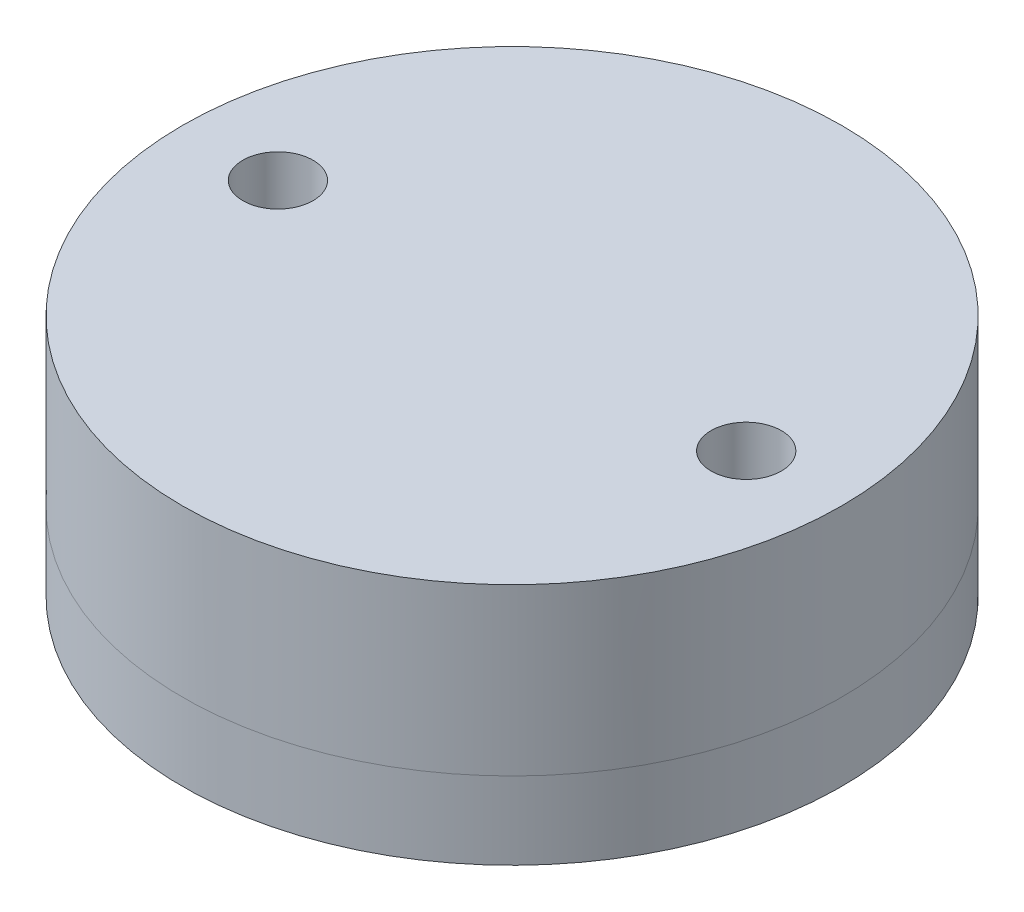
ISO-10303-21;
HEADER;
FILE_DESCRIPTION(('STEP AP214'),'2;1');
FILE_NAME('part.step','',(''),(''),'','','');
FILE_SCHEMA(('AUTOMOTIVE_DESIGN { 1 0 10303 214 1 1 1 1 }'));
ENDSEC;
DATA;
#1=APPLICATION_CONTEXT('core data for automotive mechanical design processes');
#2=APPLICATION_PROTOCOL_DEFINITION('international standard','automotive_design',2000,#1);
#3=PRODUCT_CONTEXT('',#1,'mechanical');
#4=PRODUCT('Part','Part','',(#3));
#5=PRODUCT_RELATED_PRODUCT_CATEGORY('part','',(#4));
#6=PRODUCT_DEFINITION_FORMATION('','',#4);
#7=PRODUCT_DEFINITION_CONTEXT('part definition',#1,'design');
#8=PRODUCT_DEFINITION('design','',#6,#7);
#9=PRODUCT_DEFINITION_SHAPE('','',#8);
#10=(LENGTH_UNIT() NAMED_UNIT(*) SI_UNIT(.MILLI.,.METRE.));
#11=(NAMED_UNIT(*) PLANE_ANGLE_UNIT() SI_UNIT($,.RADIAN.));
#12=(NAMED_UNIT(*) SI_UNIT($,.STERADIAN.) SOLID_ANGLE_UNIT());
#13=UNCERTAINTY_MEASURE_WITH_UNIT(LENGTH_MEASURE(1.E-05),#10,'distance_accuracy_value','');
#14=(GEOMETRIC_REPRESENTATION_CONTEXT(3) GLOBAL_UNCERTAINTY_ASSIGNED_CONTEXT((#13)) GLOBAL_UNIT_ASSIGNED_CONTEXT((#10,
#11,#12)) REPRESENTATION_CONTEXT('',''));
#15=CARTESIAN_POINT('',(0.,0.,0.));
#16=DIRECTION('',(0.,0.,1.));
#17=DIRECTION('',(1.,0.,0.));
#18=AXIS2_PLACEMENT_3D('',#15,#16,#17);
#19=CARTESIAN_POINT('',(0.,3.12256184688707,0.));
#20=DIRECTION('',(0.,1.,0.));
#21=DIRECTION('',(0.,0.,1.));
#22=AXIS2_PLACEMENT_3D('',#19,#20,#21);
#23=PLANE('',#22);
#24=CARTESIAN_POINT('',(-10.,3.12256184688707,0.));
#25=DIRECTION('',(0.,1.,0.));
#26=DIRECTION('',(0.,0.,1.));
#27=AXIS2_PLACEMENT_3D('',#24,#25,#26);
#28=CIRCLE('',#27,1.5);
#29=CARTESIAN_POINT('',(-10.,3.12256184688707,1.5));
#30=VERTEX_POINT('',#29);
#31=EDGE_CURVE('E79',#30,#30,#28,.T.);
#32=ORIENTED_EDGE('',*,*,#31,.T.);
#33=EDGE_LOOP('',(#32));
#34=FACE_BOUND('',#33,.T.);
#35=CARTESIAN_POINT('',(10.,3.12256184688707,0.));
#36=DIRECTION('',(0.,1.,0.));
#37=DIRECTION('',(0.,0.,1.));
#38=AXIS2_PLACEMENT_3D('',#35,#36,#37);
#39=CIRCLE('',#38,1.5);
#40=CARTESIAN_POINT('',(10.,3.12256184688707,1.5));
#41=VERTEX_POINT('',#40);
#42=EDGE_CURVE('E71',#41,#41,#39,.T.);
#43=ORIENTED_EDGE('',*,*,#42,.T.);
#44=EDGE_LOOP('',(#43));
#45=FACE_BOUND('',#44,.T.);
#46=CARTESIAN_POINT('',(0.,3.12256184688707,0.));
#47=DIRECTION('',(0.,-1.,0.));
#48=DIRECTION('',(0.,0.,-1.));
#49=AXIS2_PLACEMENT_3D('',#46,#47,#48);
#50=CIRCLE('',#49,7.36882129277567);
#51=CARTESIAN_POINT('',(0.,3.12256184688707,-7.36882129277567));
#52=VERTEX_POINT('',#51);
#53=EDGE_CURVE('E11',#52,#52,#50,.T.);
#54=ORIENTED_EDGE('',*,*,#53,.F.);
#55=EDGE_LOOP('',(#54));
#56=FACE_BOUND('',#55,.T.);
#57=CARTESIAN_POINT('',(0.,3.12256184688707,0.));
#58=DIRECTION('',(0.,-1.,0.));
#59=DIRECTION('',(0.,0.,-1.));
#60=AXIS2_PLACEMENT_3D('',#57,#58,#59);
#61=CIRCLE('',#60,14.075);
#62=CARTESIAN_POINT('',(0.,3.12256184688707,-14.075));
#63=VERTEX_POINT('',#62);
#64=EDGE_CURVE('E83',#63,#63,#61,.T.);
#65=ORIENTED_EDGE('',*,*,#64,.T.);
#66=EDGE_LOOP('',(#65));
#67=FACE_BOUND('',#66,.T.);
#68=ADVANCED_FACE('F54',(#34,#45,#56,#67),#23,.F.);
#69=CARTESIAN_POINT('',(0.,3.42928984872418,0.));
#70=DIRECTION('',(0.,-1.,0.));
#71=DIRECTION('',(0.,0.,-1.));
#72=AXIS2_PLACEMENT_3D('',#69,#70,#71);
#73=TOROIDAL_SURFACE('',#72,6.68441064638783,0.75);
#74=ORIENTED_EDGE('',*,*,#53,.T.);
#75=EDGE_LOOP('',(#74));
#76=FACE_BOUND('',#75,.T.);
#77=CARTESIAN_POINT('',(0.,3.73601785056129,0.));
#78=DIRECTION('',(0.,-1.,0.));
#79=DIRECTION('',(0.,0.,-1.));
#80=AXIS2_PLACEMENT_3D('',#77,#78,#79);
#81=CIRCLE('',#80,6.);
#82=CARTESIAN_POINT('',(0.,3.73601785056129,-6.));
#83=VERTEX_POINT('',#82);
#84=EDGE_CURVE('E61',#83,#83,#81,.T.);
#85=ORIENTED_EDGE('',*,*,#84,.F.);
#86=EDGE_LOOP('',(#85));
#87=FACE_BOUND('',#86,.T.);
#88=ADVANCED_FACE('F96',(#76,#87),#73,.T.);
#89=CARTESIAN_POINT('',(0.,6.425,0.));
#90=DIRECTION('',(0.,-1.,0.));
#91=DIRECTION('',(-1.,0.,0.));
#92=AXIS2_PLACEMENT_3D('',#89,#90,#91);
#93=SPHERICAL_SURFACE('',#92,6.575);
#94=CARTESIAN_POINT('',(0.,6.42500000000005,0.));
#95=DIRECTION('',(0.,-1.,0.));
#96=DIRECTION('',(0.,0.,-1.));
#97=AXIS2_PLACEMENT_3D('',#94,#95,#96);
#98=CIRCLE('',#97,6.575);
#99=CARTESIAN_POINT('',(0.,6.42500000000005,-6.575));
#100=VERTEX_POINT('',#99);
#101=EDGE_CURVE('E66',#100,#100,#98,.T.);
#102=ORIENTED_EDGE('',*,*,#101,.F.);
#103=EDGE_LOOP('',(#102));
#104=FACE_BOUND('',#103,.T.);
#105=ORIENTED_EDGE('',*,*,#84,.T.);
#106=EDGE_LOOP('',(#105));
#107=FACE_BOUND('',#106,.T.);
#108=ADVANCED_FACE('F93',(#104,#107),#93,.F.);
#109=CARTESIAN_POINT('',(0.,6.42500000000004,0.));
#110=DIRECTION('',(0.,-1.,0.));
#111=DIRECTION('',(0.,0.,-1.));
#112=AXIS2_PLACEMENT_3D('',#109,#110,#111);
#113=PLANE('',#112);
#114=CARTESIAN_POINT('',(-10.,6.42500000000004,0.));
#115=DIRECTION('',(0.,-1.,0.));
#116=DIRECTION('',(0.,0.,-1.));
#117=AXIS2_PLACEMENT_3D('',#114,#115,#116);
#118=CIRCLE('',#117,1.5);
#119=CARTESIAN_POINT('',(-10.,6.42500000000004,-1.5));
#120=VERTEX_POINT('',#119);
#121=EDGE_CURVE('E57',#120,#120,#118,.T.);
#122=ORIENTED_EDGE('',*,*,#121,.T.);
#123=EDGE_LOOP('',(#122));
#124=FACE_BOUND('',#123,.T.);
#125=CARTESIAN_POINT('',(10.,6.42500000000004,0.));
#126=DIRECTION('',(0.,-1.,0.));
#127=DIRECTION('',(0.,0.,-1.));
#128=AXIS2_PLACEMENT_3D('',#125,#126,#127);
#129=CIRCLE('',#128,1.5);
#130=CARTESIAN_POINT('',(10.,6.42500000000004,-1.5));
#131=VERTEX_POINT('',#130);
#132=EDGE_CURVE('E69',#131,#131,#129,.T.);
#133=ORIENTED_EDGE('',*,*,#132,.T.);
#134=EDGE_LOOP('',(#133));
#135=FACE_BOUND('',#134,.T.);
#136=CARTESIAN_POINT('',(0.,6.42500000000003,0.));
#137=DIRECTION('',(0.,-1.,0.));
#138=DIRECTION('',(0.,0.,-1.));
#139=AXIS2_PLACEMENT_3D('',#136,#137,#138);
#140=CIRCLE('',#139,14.075);
#141=CARTESIAN_POINT('',(0.,6.42500000000003,-14.075));
#142=VERTEX_POINT('',#141);
#143=EDGE_CURVE('E86',#142,#142,#140,.T.);
#144=ORIENTED_EDGE('',*,*,#143,.F.);
#145=EDGE_LOOP('',(#144));
#146=FACE_BOUND('',#145,.T.);
#147=ORIENTED_EDGE('',*,*,#101,.T.);
#148=EDGE_LOOP('',(#147));
#149=FACE_BOUND('',#148,.T.);
#150=ADVANCED_FACE('F91',(#124,#135,#146,#149),#113,.F.);
#151=CARTESIAN_POINT('',(0.,0.,0.));
#152=DIRECTION('',(0.,-1.,0.));
#153=DIRECTION('',(0.,0.,-1.));
#154=AXIS2_PLACEMENT_3D('',#151,#152,#153);
#155=CYLINDRICAL_SURFACE('',#154,14.075);
#156=ORIENTED_EDGE('',*,*,#64,.F.);
#157=EDGE_LOOP('',(#156));
#158=FACE_BOUND('',#157,.T.);
#159=ORIENTED_EDGE('',*,*,#143,.T.);
#160=EDGE_LOOP('',(#159));
#161=FACE_BOUND('',#160,.T.);
#162=ADVANCED_FACE('F108',(#158,#161),#155,.T.);
#163=CARTESIAN_POINT('',(10.,-10.5,0.));
#164=DIRECTION('',(0.,1.,0.));
#165=DIRECTION('',(0.,0.,1.));
#166=AXIS2_PLACEMENT_3D('',#163,#164,#165);
#167=CYLINDRICAL_SURFACE('',#166,1.5);
#168=ORIENTED_EDGE('',*,*,#132,.F.);
#169=EDGE_LOOP('',(#168));
#170=FACE_BOUND('',#169,.T.);
#171=ORIENTED_EDGE('',*,*,#42,.F.);
#172=EDGE_LOOP('',(#171));
#173=FACE_BOUND('',#172,.T.);
#174=ADVANCED_FACE('F112',(#170,#173),#167,.F.);
#175=CARTESIAN_POINT('',(-10.,-10.5,0.));
#176=DIRECTION('',(0.,1.,0.));
#177=DIRECTION('',(0.,0.,1.));
#178=AXIS2_PLACEMENT_3D('',#175,#176,#177);
#179=CYLINDRICAL_SURFACE('',#178,1.5);
#180=ORIENTED_EDGE('',*,*,#121,.F.);
#181=EDGE_LOOP('',(#180));
#182=FACE_BOUND('',#181,.T.);
#183=ORIENTED_EDGE('',*,*,#31,.F.);
#184=EDGE_LOOP('',(#183));
#185=FACE_BOUND('',#184,.T.);
#186=ADVANCED_FACE('F116',(#182,#185),#179,.F.);
#187=CLOSED_SHELL('',(#68,#88,#108,#150,#162,#174,#186));
#188=MANIFOLD_SOLID_BREP('B2',#187);
#189=CARTESIAN_POINT('',(0.,0.,0.));
#190=DIRECTION('',(0.,-1.,0.));
#191=DIRECTION('',(0.,0.,-1.));
#192=AXIS2_PLACEMENT_3D('',#189,#190,#191);
#193=CYLINDRICAL_SURFACE('',#192,14.075);
#194=CARTESIAN_POINT('',(0.,6.42499999999999,0.));
#195=DIRECTION('',(0.,-1.,0.));
#196=DIRECTION('',(0.,0.,-1.));
#197=AXIS2_PLACEMENT_3D('',#194,#195,#196);
#198=CIRCLE('',#197,14.075);
#199=CARTESIAN_POINT('',(0.,6.42499999999999,-14.075));
#200=VERTEX_POINT('',#199);
#201=EDGE_CURVE('E53',#200,#200,#198,.T.);
#202=ORIENTED_EDGE('',*,*,#201,.F.);
#203=EDGE_LOOP('',(#202));
#204=FACE_BOUND('',#203,.T.);
#205=CARTESIAN_POINT('',(0.,13.5,0.));
#206=DIRECTION('',(0.,1.,0.));
#207=DIRECTION('',(0.,0.,1.));
#208=AXIS2_PLACEMENT_3D('',#205,#206,#207);
#209=CIRCLE('',#208,14.075);
#210=CARTESIAN_POINT('',(0.,13.5,14.075));
#211=VERTEX_POINT('',#210);
#212=EDGE_CURVE('E209',#211,#211,#209,.T.);
#213=ORIENTED_EDGE('',*,*,#212,.F.);
#214=EDGE_LOOP('',(#213));
#215=FACE_BOUND('',#214,.T.);
#216=ADVANCED_FACE('F181',(#204,#215),#193,.T.);
#217=CARTESIAN_POINT('',(10.,-10.5,0.));
#218=DIRECTION('',(0.,1.,0.));
#219=DIRECTION('',(0.,0.,1.));
#220=AXIS2_PLACEMENT_3D('',#217,#218,#219);
#221=CYLINDRICAL_SURFACE('',#220,1.5);
#222=CARTESIAN_POINT('',(10.,6.425,0.));
#223=DIRECTION('',(0.,1.,0.));
#224=DIRECTION('',(0.,0.,1.));
#225=AXIS2_PLACEMENT_3D('',#222,#223,#224);
#226=CIRCLE('',#225,1.5);
#227=CARTESIAN_POINT('',(10.,6.425,1.5));
#228=VERTEX_POINT('',#227);
#229=EDGE_CURVE('E201',#228,#228,#226,.T.);
#230=ORIENTED_EDGE('',*,*,#229,.F.);
#231=EDGE_LOOP('',(#230));
#232=FACE_BOUND('',#231,.T.);
#233=CARTESIAN_POINT('',(10.,13.5,0.));
#234=DIRECTION('',(0.,1.,0.));
#235=DIRECTION('',(0.,0.,1.));
#236=AXIS2_PLACEMENT_3D('',#233,#234,#235);
#237=CIRCLE('',#236,1.5);
#238=CARTESIAN_POINT('',(10.,13.5,1.5));
#239=VERTEX_POINT('',#238);
#240=EDGE_CURVE('E205',#239,#239,#237,.F.);
#241=ORIENTED_EDGE('',*,*,#240,.F.);
#242=EDGE_LOOP('',(#241));
#243=FACE_BOUND('',#242,.T.);
#244=ADVANCED_FACE('F223',(#232,#243),#221,.F.);
#245=CARTESIAN_POINT('',(-10.,-10.5,0.));
#246=DIRECTION('',(0.,1.,0.));
#247=DIRECTION('',(0.,0.,1.));
#248=AXIS2_PLACEMENT_3D('',#245,#246,#247);
#249=CYLINDRICAL_SURFACE('',#248,1.5);
#250=CARTESIAN_POINT('',(-10.,6.425,0.));
#251=DIRECTION('',(0.,1.,0.));
#252=DIRECTION('',(0.,0.,1.));
#253=AXIS2_PLACEMENT_3D('',#250,#251,#252);
#254=CIRCLE('',#253,1.5);
#255=CARTESIAN_POINT('',(-10.,6.425,1.5));
#256=VERTEX_POINT('',#255);
#257=EDGE_CURVE('E195',#256,#256,#254,.T.);
#258=ORIENTED_EDGE('',*,*,#257,.F.);
#259=EDGE_LOOP('',(#258));
#260=FACE_BOUND('',#259,.T.);
#261=CARTESIAN_POINT('',(-10.,13.5,0.));
#262=DIRECTION('',(0.,1.,0.));
#263=DIRECTION('',(0.,0.,1.));
#264=AXIS2_PLACEMENT_3D('',#261,#262,#263);
#265=CIRCLE('',#264,1.5);
#266=CARTESIAN_POINT('',(-10.,13.5,1.5));
#267=VERTEX_POINT('',#266);
#268=EDGE_CURVE('E185',#267,#267,#265,.F.);
#269=ORIENTED_EDGE('',*,*,#268,.F.);
#270=EDGE_LOOP('',(#269));
#271=FACE_BOUND('',#270,.T.);
#272=ADVANCED_FACE('F221',(#260,#271),#249,.F.);
#273=CARTESIAN_POINT('',(-2.26627166107395E-13,6.425,0.));
#274=DIRECTION('',(0.,1.,0.));
#275=DIRECTION('',(0.,0.,1.));
#276=AXIS2_PLACEMENT_3D('',#273,#274,#275);
#277=PLANE('',#276);
#278=ORIENTED_EDGE('',*,*,#257,.T.);
#279=EDGE_LOOP('',(#278));
#280=FACE_BOUND('',#279,.T.);
#281=ORIENTED_EDGE('',*,*,#229,.T.);
#282=EDGE_LOOP('',(#281));
#283=FACE_BOUND('',#282,.T.);
#284=CARTESIAN_POINT('',(0.,6.425,0.));
#285=DIRECTION('',(0.,-1.,0.));
#286=DIRECTION('',(0.,0.,-1.));
#287=AXIS2_PLACEMENT_3D('',#284,#285,#286);
#288=CIRCLE('',#287,6.575);
#289=CARTESIAN_POINT('',(0.,6.425,-6.575));
#290=VERTEX_POINT('',#289);
#291=EDGE_CURVE('E190',#290,#290,#288,.T.);
#292=ORIENTED_EDGE('',*,*,#291,.F.);
#293=EDGE_LOOP('',(#292));
#294=FACE_BOUND('',#293,.T.);
#295=ORIENTED_EDGE('',*,*,#201,.T.);
#296=EDGE_LOOP('',(#295));
#297=FACE_BOUND('',#296,.T.);
#298=ADVANCED_FACE('F183',(#280,#283,#294,#297),#277,.F.);
#299=CARTESIAN_POINT('',(0.,6.425,0.));
#300=DIRECTION('',(0.,-1.,0.));
#301=DIRECTION('',(-1.,0.,0.));
#302=AXIS2_PLACEMENT_3D('',#299,#300,#301);
#303=SPHERICAL_SURFACE('',#302,6.575);
#304=ORIENTED_EDGE('',*,*,#291,.T.);
#305=EDGE_LOOP('',(#304));
#306=FACE_BOUND('',#305,.T.);
#307=ADVANCED_FACE('F231',(#306),#303,.F.);
#308=CARTESIAN_POINT('',(0.,13.5,0.));
#309=DIRECTION('',(0.,1.,0.));
#310=DIRECTION('',(0.,0.,1.));
#311=AXIS2_PLACEMENT_3D('',#308,#309,#310);
#312=PLANE('',#311);
#313=ORIENTED_EDGE('',*,*,#212,.T.);
#314=EDGE_LOOP('',(#313));
#315=FACE_BOUND('',#314,.T.);
#316=ORIENTED_EDGE('',*,*,#268,.T.);
#317=EDGE_LOOP('',(#316));
#318=FACE_BOUND('',#317,.T.);
#319=ORIENTED_EDGE('',*,*,#240,.T.);
#320=EDGE_LOOP('',(#319));
#321=FACE_BOUND('',#320,.T.);
#322=ADVANCED_FACE('F218',(#315,#318,#321),#312,.T.);
#323=CLOSED_SHELL('',(#216,#244,#272,#298,#307,#322));
#324=MANIFOLD_SOLID_BREP('B6',#323);
#325=CARTESIAN_POINT('',(0.,6.425,0.));
#326=DIRECTION('',(0.,-1.,0.));
#327=DIRECTION('',(-1.,0.,0.));
#328=AXIS2_PLACEMENT_3D('',#325,#326,#327);
#329=SPHERICAL_SURFACE('',#328,6.425);
#330=CARTESIAN_POINT('',(0.,0.,0.));
#331=VERTEX_POINT('',#330);
#332=VERTEX_LOOP('',#331);
#333=FACE_BOUND('',#332,.T.);
#334=ADVANCED_FACE('F289',(#333),#329,.T.);
#335=CLOSED_SHELL('',(#334));
#336=MANIFOLD_SOLID_BREP('B48',#335);
#337=ADVANCED_BREP_SHAPE_REPRESENTATION('',(#18,#188,#324,#336),#14);
#338=SHAPE_DEFINITION_REPRESENTATION(#9,#337);
ENDSEC;
END-ISO-10303-21;
